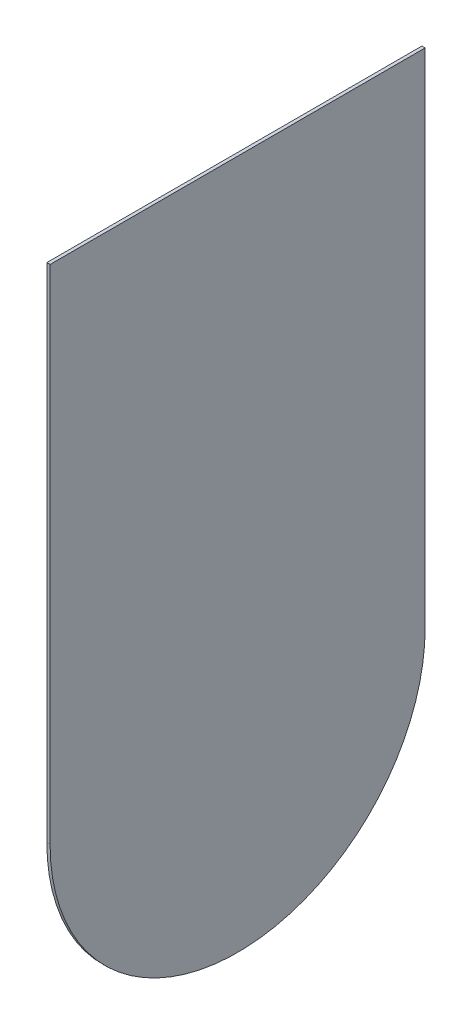
ISO-10303-21;
HEADER;
FILE_DESCRIPTION(('STEP AP214'),'2;1');
FILE_NAME('part.step','',(''),(''),'','','');
FILE_SCHEMA(('AUTOMOTIVE_DESIGN { 1 0 10303 214 1 1 1 1 }'));
ENDSEC;
DATA;
#1=APPLICATION_CONTEXT('core data for automotive mechanical design processes');
#2=APPLICATION_PROTOCOL_DEFINITION('international standard','automotive_design',2000,#1);
#3=PRODUCT_CONTEXT('',#1,'mechanical');
#4=PRODUCT('Part','Part','',(#3));
#5=PRODUCT_RELATED_PRODUCT_CATEGORY('part','',(#4));
#6=PRODUCT_DEFINITION_FORMATION('','',#4);
#7=PRODUCT_DEFINITION_CONTEXT('part definition',#1,'design');
#8=PRODUCT_DEFINITION('design','',#6,#7);
#9=PRODUCT_DEFINITION_SHAPE('','',#8);
#10=(LENGTH_UNIT() NAMED_UNIT(*) SI_UNIT(.MILLI.,.METRE.));
#11=(NAMED_UNIT(*) PLANE_ANGLE_UNIT() SI_UNIT($,.RADIAN.));
#12=(NAMED_UNIT(*) SI_UNIT($,.STERADIAN.) SOLID_ANGLE_UNIT());
#13=UNCERTAINTY_MEASURE_WITH_UNIT(LENGTH_MEASURE(1.E-05),#10,'distance_accuracy_value','');
#14=(GEOMETRIC_REPRESENTATION_CONTEXT(3) GLOBAL_UNCERTAINTY_ASSIGNED_CONTEXT((#13)) GLOBAL_UNIT_ASSIGNED_CONTEXT((#10,
#11,#12)) REPRESENTATION_CONTEXT('',''));
#15=CARTESIAN_POINT('',(0.,0.,0.));
#16=DIRECTION('',(0.,0.,1.));
#17=DIRECTION('',(1.,0.,0.));
#18=AXIS2_PLACEMENT_3D('',#15,#16,#17);
#19=CARTESIAN_POINT('',(0.22,-12.9466019417476,0.616504854368932));
#20=DIRECTION('',(-1.,0.,0.));
#21=DIRECTION('',(0.,0.,1.));
#22=AXIS2_PLACEMENT_3D('',#19,#20,#21);
#23=CYLINDRICAL_SURFACE('',#22,12.7);
#24=CARTESIAN_POINT('',(0.,-12.9466019417476,0.616504854368932));
#25=DIRECTION('',(1.,0.,0.));
#26=DIRECTION('',(0.,0.,-1.));
#27=AXIS2_PLACEMENT_3D('',#24,#25,#26);
#28=CIRCLE('',#27,12.7);
#29=CARTESIAN_POINT('',(0.,-12.9466019417476,13.3165048543689));
#30=VERTEX_POINT('',#29);
#31=CARTESIAN_POINT('',(0.,-12.9466019417476,-12.0834951456311));
#32=VERTEX_POINT('',#31);
#33=EDGE_CURVE('E103',#30,#32,#28,.T.);
#34=ORIENTED_EDGE('',*,*,#33,.T.);
#35=DIRECTION('',(-1.,0.,0.));
#36=VECTOR('',#35,1.);
#37=CARTESIAN_POINT('',(0.22,-12.9466019417476,-12.0834951456311));
#38=LINE('',#37,#36);
#39=CARTESIAN_POINT('',(0.22,-12.9466019417476,-12.0834951456311));
#40=VERTEX_POINT('',#39);
#41=EDGE_CURVE('E11',#40,#32,#38,.T.);
#42=ORIENTED_EDGE('',*,*,#41,.F.);
#43=CARTESIAN_POINT('',(0.22,-12.9466019417476,0.616504854368932));
#44=DIRECTION('',(1.,0.,0.));
#45=DIRECTION('',(0.,0.,-1.));
#46=AXIS2_PLACEMENT_3D('',#43,#44,#45);
#47=CIRCLE('',#46,12.7);
#48=CARTESIAN_POINT('',(0.22,-12.9466019417476,13.3165048543689));
#49=VERTEX_POINT('',#48);
#50=EDGE_CURVE('E80',#49,#40,#47,.T.);
#51=ORIENTED_EDGE('',*,*,#50,.F.);
#52=DIRECTION('',(-1.,0.,0.));
#53=VECTOR('',#52,1.);
#54=CARTESIAN_POINT('',(0.22,-12.9466019417476,13.3165048543689));
#55=LINE('',#54,#53);
#56=EDGE_CURVE('E99',#49,#30,#55,.T.);
#57=ORIENTED_EDGE('',*,*,#56,.T.);
#58=EDGE_LOOP('',(#34,#42,#51,#57));
#59=FACE_BOUND('',#58,.T.);
#60=ADVANCED_FACE('F41',(#59),#23,.T.);
#61=CARTESIAN_POINT('',(0.22,0.,-12.0834951456311));
#62=DIRECTION('',(0.,0.,-1.));
#63=DIRECTION('',(0.,1.,0.));
#64=AXIS2_PLACEMENT_3D('',#61,#62,#63);
#65=PLANE('',#64);
#66=DIRECTION('',(0.,-1.,0.));
#67=VECTOR('',#66,1.);
#68=CARTESIAN_POINT('',(0.,0.,-12.0834951456311));
#69=LINE('',#68,#67);
#70=CARTESIAN_POINT('',(0.,21.0533980582524,-12.0834951456311));
#71=VERTEX_POINT('',#70);
#72=EDGE_CURVE('E89',#71,#32,#69,.T.);
#73=ORIENTED_EDGE('',*,*,#72,.F.);
#74=DIRECTION('',(-1.,0.,0.));
#75=VECTOR('',#74,1.);
#76=CARTESIAN_POINT('',(0.22,21.0533980582524,-12.0834951456311));
#77=LINE('',#76,#75);
#78=CARTESIAN_POINT('',(0.22,21.0533980582524,-12.0834951456311));
#79=VERTEX_POINT('',#78);
#80=EDGE_CURVE('E49',#79,#71,#77,.T.);
#81=ORIENTED_EDGE('',*,*,#80,.F.);
#82=DIRECTION('',(0.,-1.,0.));
#83=VECTOR('',#82,1.);
#84=CARTESIAN_POINT('',(0.22,0.,-12.0834951456311));
#85=LINE('',#84,#83);
#86=EDGE_CURVE('E87',#79,#40,#85,.T.);
#87=ORIENTED_EDGE('',*,*,#86,.T.);
#88=ORIENTED_EDGE('',*,*,#41,.T.);
#89=EDGE_LOOP('',(#73,#81,#87,#88));
#90=FACE_BOUND('',#89,.T.);
#91=ADVANCED_FACE('F86',(#90),#65,.T.);
#92=CARTESIAN_POINT('',(0.22,21.0533980582524,0.));
#93=DIRECTION('',(0.,1.,0.));
#94=DIRECTION('',(0.,0.,1.));
#95=AXIS2_PLACEMENT_3D('',#92,#93,#94);
#96=PLANE('',#95);
#97=DIRECTION('',(0.,0.,-1.));
#98=VECTOR('',#97,1.);
#99=CARTESIAN_POINT('',(0.,21.0533980582524,0.));
#100=LINE('',#99,#98);
#101=CARTESIAN_POINT('',(0.,21.0533980582524,13.3165048543689));
#102=VERTEX_POINT('',#101);
#103=EDGE_CURVE('E107',#102,#71,#100,.T.);
#104=ORIENTED_EDGE('',*,*,#103,.F.);
#105=DIRECTION('',(-1.,0.,0.));
#106=VECTOR('',#105,1.);
#107=CARTESIAN_POINT('',(0.22,21.0533980582524,13.3165048543689));
#108=LINE('',#107,#106);
#109=CARTESIAN_POINT('',(0.22,21.0533980582524,13.3165048543689));
#110=VERTEX_POINT('',#109);
#111=EDGE_CURVE('E72',#110,#102,#108,.T.);
#112=ORIENTED_EDGE('',*,*,#111,.F.);
#113=DIRECTION('',(0.,0.,-1.));
#114=VECTOR('',#113,1.);
#115=CARTESIAN_POINT('',(0.22,21.0533980582524,0.));
#116=LINE('',#115,#114);
#117=EDGE_CURVE('E95',#110,#79,#116,.T.);
#118=ORIENTED_EDGE('',*,*,#117,.T.);
#119=ORIENTED_EDGE('',*,*,#80,.T.);
#120=EDGE_LOOP('',(#104,#112,#118,#119));
#121=FACE_BOUND('',#120,.T.);
#122=ADVANCED_FACE('F97',(#121),#96,.T.);
#123=CARTESIAN_POINT('',(0.22,0.,13.3165048543689));
#124=DIRECTION('',(0.,0.,-1.));
#125=DIRECTION('',(0.,1.,0.));
#126=AXIS2_PLACEMENT_3D('',#123,#124,#125);
#127=PLANE('',#126);
#128=DIRECTION('',(0.,-1.,0.));
#129=VECTOR('',#128,1.);
#130=CARTESIAN_POINT('',(0.,0.,13.3165048543689));
#131=LINE('',#130,#129);
#132=EDGE_CURVE('E75',#102,#30,#131,.T.);
#133=ORIENTED_EDGE('',*,*,#132,.T.);
#134=ORIENTED_EDGE('',*,*,#56,.F.);
#135=DIRECTION('',(0.,-1.,0.));
#136=VECTOR('',#135,1.);
#137=CARTESIAN_POINT('',(0.22,0.,13.3165048543689));
#138=LINE('',#137,#136);
#139=EDGE_CURVE('E57',#110,#49,#138,.T.);
#140=ORIENTED_EDGE('',*,*,#139,.F.);
#141=ORIENTED_EDGE('',*,*,#111,.T.);
#142=EDGE_LOOP('',(#133,#134,#140,#141));
#143=FACE_BOUND('',#142,.T.);
#144=ADVANCED_FACE('F120',(#143),#127,.F.);
#145=CARTESIAN_POINT('',(0.22,0.,0.));
#146=DIRECTION('',(1.,0.,0.));
#147=DIRECTION('',(0.,0.,-1.));
#148=AXIS2_PLACEMENT_3D('',#145,#146,#147);
#149=PLANE('',#148);
#150=ORIENTED_EDGE('',*,*,#50,.T.);
#151=ORIENTED_EDGE('',*,*,#86,.F.);
#152=ORIENTED_EDGE('',*,*,#117,.F.);
#153=ORIENTED_EDGE('',*,*,#139,.T.);
#154=EDGE_LOOP('',(#150,#151,#152,#153));
#155=FACE_BOUND('',#154,.T.);
#156=ADVANCED_FACE('F94',(#155),#149,.T.);
#157=CARTESIAN_POINT('',(0.,0.,0.));
#158=DIRECTION('',(1.,0.,0.));
#159=DIRECTION('',(0.,0.,-1.));
#160=AXIS2_PLACEMENT_3D('',#157,#158,#159);
#161=PLANE('',#160);
#162=ORIENTED_EDGE('',*,*,#33,.F.);
#163=ORIENTED_EDGE('',*,*,#132,.F.);
#164=ORIENTED_EDGE('',*,*,#103,.T.);
#165=ORIENTED_EDGE('',*,*,#72,.T.);
#166=EDGE_LOOP('',(#162,#163,#164,#165));
#167=FACE_BOUND('',#166,.T.);
#168=ADVANCED_FACE('F114',(#167),#161,.F.);
#169=CLOSED_SHELL('',(#60,#91,#122,#144,#156,#168));
#170=MANIFOLD_SOLID_BREP('B2',#169);
#171=ADVANCED_BREP_SHAPE_REPRESENTATION('',(#18,#170),#14);
#172=SHAPE_DEFINITION_REPRESENTATION(#9,#171);
ENDSEC;
END-ISO-10303-21;
